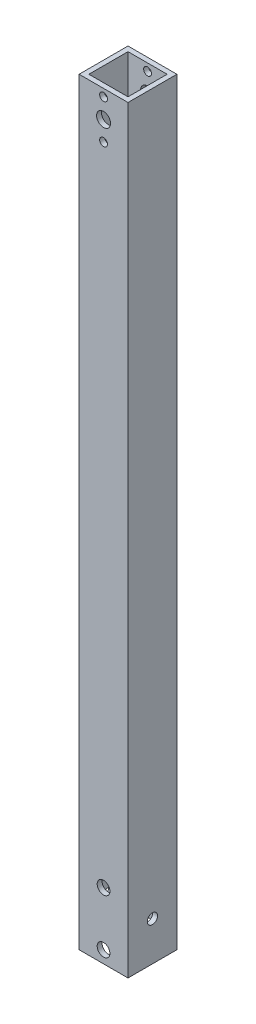
ISO-10303-21;
HEADER;
FILE_DESCRIPTION(('STEP AP214'),'2;1');
FILE_NAME('part.step','',(''),(''),'','','');
FILE_SCHEMA(('AUTOMOTIVE_DESIGN { 1 0 10303 214 1 1 1 1 }'));
ENDSEC;
DATA;
#1=APPLICATION_CONTEXT('core data for automotive mechanical design processes');
#2=APPLICATION_PROTOCOL_DEFINITION('international standard','automotive_design',2000,#1);
#3=PRODUCT_CONTEXT('',#1,'mechanical');
#4=PRODUCT('Part','Part','',(#3));
#5=PRODUCT_RELATED_PRODUCT_CATEGORY('part','',(#4));
#6=PRODUCT_DEFINITION_FORMATION('','',#4);
#7=PRODUCT_DEFINITION_CONTEXT('part definition',#1,'design');
#8=PRODUCT_DEFINITION('design','',#6,#7);
#9=PRODUCT_DEFINITION_SHAPE('','',#8);
#10=(LENGTH_UNIT() NAMED_UNIT(*) SI_UNIT(.MILLI.,.METRE.));
#11=(NAMED_UNIT(*) PLANE_ANGLE_UNIT() SI_UNIT($,.RADIAN.));
#12=(NAMED_UNIT(*) SI_UNIT($,.STERADIAN.) SOLID_ANGLE_UNIT());
#13=UNCERTAINTY_MEASURE_WITH_UNIT(LENGTH_MEASURE(1.E-05),#10,'distance_accuracy_value','');
#14=(GEOMETRIC_REPRESENTATION_CONTEXT(3) GLOBAL_UNCERTAINTY_ASSIGNED_CONTEXT((#13)) GLOBAL_UNIT_ASSIGNED_CONTEXT((#10,
#11,#12)) REPRESENTATION_CONTEXT('',''));
#15=CARTESIAN_POINT('',(0.,0.,0.));
#16=DIRECTION('',(0.,0.,1.));
#17=DIRECTION('',(1.,0.,0.));
#18=AXIS2_PLACEMENT_3D('',#15,#16,#17);
#19=CARTESIAN_POINT('',(0.,310.,0.));
#20=DIRECTION('',(0.,1.,0.));
#21=DIRECTION('',(0.,0.,1.));
#22=AXIS2_PLACEMENT_3D('',#19,#20,#21);
#23=PLANE('',#22);
#24=DIRECTION('',(0.,0.,1.));
#25=VECTOR('',#24,1.);
#26=CARTESIAN_POINT('',(0.,310.,0.));
#27=LINE('',#26,#25);
#28=CARTESIAN_POINT('',(0.,310.,-20.));
#29=VERTEX_POINT('',#28);
#30=CARTESIAN_POINT('',(0.,310.,0.));
#31=VERTEX_POINT('',#30);
#32=EDGE_CURVE('E166',#29,#31,#27,.T.);
#33=ORIENTED_EDGE('',*,*,#32,.T.);
#34=DIRECTION('',(1.,0.,0.));
#35=VECTOR('',#34,1.);
#36=CARTESIAN_POINT('',(0.,310.,0.));
#37=LINE('',#36,#35);
#38=CARTESIAN_POINT('',(20.,310.,0.));
#39=VERTEX_POINT('',#38);
#40=EDGE_CURVE('E169',#31,#39,#37,.T.);
#41=ORIENTED_EDGE('',*,*,#40,.T.);
#42=DIRECTION('',(0.,0.,-1.));
#43=VECTOR('',#42,1.);
#44=CARTESIAN_POINT('',(20.,310.,0.));
#45=LINE('',#44,#43);
#46=CARTESIAN_POINT('',(20.,310.,-20.));
#47=VERTEX_POINT('',#46);
#48=EDGE_CURVE('E172',#39,#47,#45,.T.);
#49=ORIENTED_EDGE('',*,*,#48,.T.);
#50=DIRECTION('',(-1.,0.,0.));
#51=VECTOR('',#50,1.);
#52=CARTESIAN_POINT('',(0.,310.,-20.));
#53=LINE('',#52,#51);
#54=EDGE_CURVE('E174',#47,#29,#53,.T.);
#55=ORIENTED_EDGE('',*,*,#54,.T.);
#56=EDGE_LOOP('',(#33,#41,#49,#55));
#57=FACE_BOUND('',#56,.T.);
#58=DIRECTION('',(1.,0.,0.));
#59=VECTOR('',#58,1.);
#60=CARTESIAN_POINT('',(0.,310.,-2.));
#61=LINE('',#60,#59);
#62=CARTESIAN_POINT('',(2.,310.,-2.));
#63=VERTEX_POINT('',#62);
#64=CARTESIAN_POINT('',(18.,310.,-2.));
#65=VERTEX_POINT('',#64);
#66=EDGE_CURVE('E136',#63,#65,#61,.T.);
#67=ORIENTED_EDGE('',*,*,#66,.F.);
#68=DIRECTION('',(0.,0.,1.));
#69=VECTOR('',#68,1.);
#70=CARTESIAN_POINT('',(2.,310.,0.));
#71=LINE('',#70,#69);
#72=CARTESIAN_POINT('',(2.,310.,-18.));
#73=VERTEX_POINT('',#72);
#74=EDGE_CURVE('E128',#73,#63,#71,.T.);
#75=ORIENTED_EDGE('',*,*,#74,.F.);
#76=DIRECTION('',(-1.,0.,0.));
#77=VECTOR('',#76,1.);
#78=CARTESIAN_POINT('',(0.,310.,-18.));
#79=LINE('',#78,#77);
#80=CARTESIAN_POINT('',(18.,310.,-18.));
#81=VERTEX_POINT('',#80);
#82=EDGE_CURVE('E150',#81,#73,#79,.T.);
#83=ORIENTED_EDGE('',*,*,#82,.F.);
#84=DIRECTION('',(0.,0.,-1.));
#85=VECTOR('',#84,1.);
#86=CARTESIAN_POINT('',(18.,310.,0.));
#87=LINE('',#86,#85);
#88=EDGE_CURVE('E148',#65,#81,#87,.T.);
#89=ORIENTED_EDGE('',*,*,#88,.F.);
#90=EDGE_LOOP('',(#67,#75,#83,#89));
#91=FACE_BOUND('',#90,.T.);
#92=ADVANCED_FACE('F61',(#57,#91),#23,.T.);
#93=CARTESIAN_POINT('',(0.,0.,0.));
#94=DIRECTION('',(0.,1.,0.));
#95=DIRECTION('',(0.,0.,1.));
#96=AXIS2_PLACEMENT_3D('',#93,#94,#95);
#97=PLANE('',#96);
#98=DIRECTION('',(0.,0.,1.));
#99=VECTOR('',#98,1.);
#100=CARTESIAN_POINT('',(0.,0.,0.));
#101=LINE('',#100,#99);
#102=CARTESIAN_POINT('',(0.,0.,-20.));
#103=VERTEX_POINT('',#102);
#104=CARTESIAN_POINT('',(0.,0.,0.));
#105=VERTEX_POINT('',#104);
#106=EDGE_CURVE('E144',#103,#105,#101,.T.);
#107=ORIENTED_EDGE('',*,*,#106,.F.);
#108=DIRECTION('',(-1.,0.,0.));
#109=VECTOR('',#108,1.);
#110=CARTESIAN_POINT('',(0.,0.,-20.));
#111=LINE('',#110,#109);
#112=CARTESIAN_POINT('',(20.,0.,-20.));
#113=VERTEX_POINT('',#112);
#114=EDGE_CURVE('E170',#113,#103,#111,.T.);
#115=ORIENTED_EDGE('',*,*,#114,.F.);
#116=DIRECTION('',(0.,0.,-1.));
#117=VECTOR('',#116,1.);
#118=CARTESIAN_POINT('',(20.,0.,0.));
#119=LINE('',#118,#117);
#120=CARTESIAN_POINT('',(20.,0.,0.));
#121=VERTEX_POINT('',#120);
#122=EDGE_CURVE('E181',#121,#113,#119,.T.);
#123=ORIENTED_EDGE('',*,*,#122,.F.);
#124=DIRECTION('',(1.,0.,0.));
#125=VECTOR('',#124,1.);
#126=CARTESIAN_POINT('',(0.,0.,0.));
#127=LINE('',#126,#125);
#128=EDGE_CURVE('E179',#105,#121,#127,.T.);
#129=ORIENTED_EDGE('',*,*,#128,.F.);
#130=EDGE_LOOP('',(#107,#115,#123,#129));
#131=FACE_BOUND('',#130,.T.);
#132=DIRECTION('',(0.,0.,1.));
#133=VECTOR('',#132,1.);
#134=CARTESIAN_POINT('',(2.,0.,0.));
#135=LINE('',#134,#133);
#136=CARTESIAN_POINT('',(2.,0.,-18.));
#137=VERTEX_POINT('',#136);
#138=CARTESIAN_POINT('',(2.,0.,-2.));
#139=VERTEX_POINT('',#138);
#140=EDGE_CURVE('E86',#137,#139,#135,.T.);
#141=ORIENTED_EDGE('',*,*,#140,.T.);
#142=DIRECTION('',(1.,0.,0.));
#143=VECTOR('',#142,1.);
#144=CARTESIAN_POINT('',(0.,0.,-2.));
#145=LINE('',#144,#143);
#146=CARTESIAN_POINT('',(18.,0.,-2.));
#147=VERTEX_POINT('',#146);
#148=EDGE_CURVE('E143',#139,#147,#145,.T.);
#149=ORIENTED_EDGE('',*,*,#148,.T.);
#150=DIRECTION('',(0.,0.,-1.));
#151=VECTOR('',#150,1.);
#152=CARTESIAN_POINT('',(18.,0.,0.));
#153=LINE('',#152,#151);
#154=CARTESIAN_POINT('',(18.,0.,-18.));
#155=VERTEX_POINT('',#154);
#156=EDGE_CURVE('E158',#147,#155,#153,.T.);
#157=ORIENTED_EDGE('',*,*,#156,.T.);
#158=DIRECTION('',(-1.,0.,0.));
#159=VECTOR('',#158,1.);
#160=CARTESIAN_POINT('',(0.,0.,-18.));
#161=LINE('',#160,#159);
#162=EDGE_CURVE('E137',#155,#137,#161,.T.);
#163=ORIENTED_EDGE('',*,*,#162,.T.);
#164=EDGE_LOOP('',(#141,#149,#157,#163));
#165=FACE_BOUND('',#164,.T.);
#166=ADVANCED_FACE('F280',(#131,#165),#97,.F.);
#167=CARTESIAN_POINT('',(0.,310.,0.));
#168=DIRECTION('',(1.,0.,0.));
#169=DIRECTION('',(0.,0.,-1.));
#170=AXIS2_PLACEMENT_3D('',#167,#168,#169);
#171=PLANE('',#170);
#172=CARTESIAN_POINT('',(0.,16.,-10.));
#173=DIRECTION('',(-1.,0.,0.));
#174=DIRECTION('',(0.,0.,1.));
#175=AXIS2_PLACEMENT_3D('',#172,#173,#174);
#176=CIRCLE('',#175,2.1);
#177=CARTESIAN_POINT('',(0.,16.,-7.9));
#178=VERTEX_POINT('',#177);
#179=EDGE_CURVE('E308',#178,#178,#176,.T.);
#180=ORIENTED_EDGE('',*,*,#179,.F.);
#181=EDGE_LOOP('',(#180));
#182=FACE_BOUND('',#181,.T.);
#183=ORIENTED_EDGE('',*,*,#106,.T.);
#184=DIRECTION('',(0.,-1.,0.));
#185=VECTOR('',#184,1.);
#186=CARTESIAN_POINT('',(0.,310.,0.));
#187=LINE('',#186,#185);
#188=EDGE_CURVE('E12',#31,#105,#187,.T.);
#189=ORIENTED_EDGE('',*,*,#188,.F.);
#190=ORIENTED_EDGE('',*,*,#32,.F.);
#191=DIRECTION('',(0.,-1.,0.));
#192=VECTOR('',#191,1.);
#193=CARTESIAN_POINT('',(0.,310.,-20.));
#194=LINE('',#193,#192);
#195=EDGE_CURVE('E176',#29,#103,#194,.T.);
#196=ORIENTED_EDGE('',*,*,#195,.T.);
#197=EDGE_LOOP('',(#183,#189,#190,#196));
#198=FACE_BOUND('',#197,.T.);
#199=ADVANCED_FACE('F63',(#182,#198),#171,.F.);
#200=CARTESIAN_POINT('',(0.,310.,0.));
#201=DIRECTION('',(0.,0.,-1.));
#202=DIRECTION('',(-1.,0.,0.));
#203=AXIS2_PLACEMENT_3D('',#200,#201,#202);
#204=PLANE('',#203);
#205=CARTESIAN_POINT('',(10.0000000000021,5.00000000000006,0.));
#206=DIRECTION('',(0.,0.,-1.));
#207=DIRECTION('',(-1.,0.,0.));
#208=AXIS2_PLACEMENT_3D('',#205,#206,#207);
#209=CIRCLE('',#208,2.6);
#210=CARTESIAN_POINT('',(7.40000000000211,5.00000000000006,0.));
#211=VERTEX_POINT('',#210);
#212=EDGE_CURVE('E206',#211,#211,#209,.T.);
#213=ORIENTED_EDGE('',*,*,#212,.T.);
#214=EDGE_LOOP('',(#213));
#215=FACE_BOUND('',#214,.T.);
#216=CARTESIAN_POINT('',(10.0000000000021,27.,0.));
#217=DIRECTION('',(0.,0.,-1.));
#218=DIRECTION('',(-1.,0.,0.));
#219=AXIS2_PLACEMENT_3D('',#216,#217,#218);
#220=CIRCLE('',#219,2.6);
#221=CARTESIAN_POINT('',(7.4000000000021,27.,0.));
#222=VERTEX_POINT('',#221);
#223=EDGE_CURVE('E321',#222,#222,#220,.T.);
#224=ORIENTED_EDGE('',*,*,#223,.T.);
#225=EDGE_LOOP('',(#224));
#226=FACE_BOUND('',#225,.T.);
#227=CARTESIAN_POINT('',(10.,307.,0.));
#228=DIRECTION('',(0.,0.,1.));
#229=DIRECTION('',(1.,0.,0.));
#230=AXIS2_PLACEMENT_3D('',#227,#228,#229);
#231=CIRCLE('',#230,1.59999999999999);
#232=CARTESIAN_POINT('',(11.6,307.,0.));
#233=VERTEX_POINT('',#232);
#234=EDGE_CURVE('E213',#233,#233,#231,.T.);
#235=ORIENTED_EDGE('',*,*,#234,.F.);
#236=EDGE_LOOP('',(#235));
#237=FACE_BOUND('',#236,.T.);
#238=CARTESIAN_POINT('',(10.,291.,0.));
#239=DIRECTION('',(0.,0.,1.));
#240=DIRECTION('',(1.,0.,0.));
#241=AXIS2_PLACEMENT_3D('',#238,#239,#240);
#242=CIRCLE('',#241,1.6);
#243=CARTESIAN_POINT('',(11.6,291.,0.));
#244=VERTEX_POINT('',#243);
#245=EDGE_CURVE('E227',#244,#244,#242,.T.);
#246=ORIENTED_EDGE('',*,*,#245,.F.);
#247=EDGE_LOOP('',(#246));
#248=FACE_BOUND('',#247,.T.);
#249=CARTESIAN_POINT('',(10.,299.,0.));
#250=DIRECTION('',(0.,0.,1.));
#251=DIRECTION('',(1.,0.,0.));
#252=AXIS2_PLACEMENT_3D('',#249,#250,#251);
#253=CIRCLE('',#252,2.84999999999999);
#254=CARTESIAN_POINT('',(12.85,299.,0.));
#255=VERTEX_POINT('',#254);
#256=EDGE_CURVE('E226',#255,#255,#253,.T.);
#257=ORIENTED_EDGE('',*,*,#256,.F.);
#258=EDGE_LOOP('',(#257));
#259=FACE_BOUND('',#258,.T.);
#260=ORIENTED_EDGE('',*,*,#128,.T.);
#261=DIRECTION('',(0.,-1.,0.));
#262=VECTOR('',#261,1.);
#263=CARTESIAN_POINT('',(20.,310.,0.));
#264=LINE('',#263,#262);
#265=EDGE_CURVE('E70',#39,#121,#264,.T.);
#266=ORIENTED_EDGE('',*,*,#265,.F.);
#267=ORIENTED_EDGE('',*,*,#40,.F.);
#268=ORIENTED_EDGE('',*,*,#188,.T.);
#269=EDGE_LOOP('',(#260,#266,#267,#268));
#270=FACE_BOUND('',#269,.T.);
#271=ADVANCED_FACE('F266',(#215,#226,#237,#248,#259,#270),#204,.F.);
#272=CARTESIAN_POINT('',(20.,310.,0.));
#273=DIRECTION('',(-1.,0.,0.));
#274=DIRECTION('',(0.,0.,1.));
#275=AXIS2_PLACEMENT_3D('',#272,#273,#274);
#276=PLANE('',#275);
#277=CARTESIAN_POINT('',(20.,16.,-10.));
#278=DIRECTION('',(-1.,0.,0.));
#279=DIRECTION('',(0.,0.,1.));
#280=AXIS2_PLACEMENT_3D('',#277,#278,#279);
#281=CIRCLE('',#280,2.1);
#282=CARTESIAN_POINT('',(20.,16.,-7.9));
#283=VERTEX_POINT('',#282);
#284=EDGE_CURVE('E306',#283,#283,#281,.T.);
#285=ORIENTED_EDGE('',*,*,#284,.T.);
#286=EDGE_LOOP('',(#285));
#287=FACE_BOUND('',#286,.T.);
#288=ORIENTED_EDGE('',*,*,#122,.T.);
#289=DIRECTION('',(0.,-1.,0.));
#290=VECTOR('',#289,1.);
#291=CARTESIAN_POINT('',(20.,310.,-20.));
#292=LINE('',#291,#290);
#293=EDGE_CURVE('E186',#47,#113,#292,.T.);
#294=ORIENTED_EDGE('',*,*,#293,.F.);
#295=ORIENTED_EDGE('',*,*,#48,.F.);
#296=ORIENTED_EDGE('',*,*,#265,.T.);
#297=EDGE_LOOP('',(#288,#294,#295,#296));
#298=FACE_BOUND('',#297,.T.);
#299=ADVANCED_FACE('F269',(#287,#298),#276,.F.);
#300=CARTESIAN_POINT('',(0.,310.,-20.));
#301=DIRECTION('',(0.,0.,1.));
#302=DIRECTION('',(1.,0.,0.));
#303=AXIS2_PLACEMENT_3D('',#300,#301,#302);
#304=PLANE('',#303);
#305=CARTESIAN_POINT('',(10.0000000000021,5.00000000000006,-20.));
#306=DIRECTION('',(0.,0.,-1.));
#307=DIRECTION('',(-1.,0.,0.));
#308=AXIS2_PLACEMENT_3D('',#305,#306,#307);
#309=CIRCLE('',#308,2.6);
#310=CARTESIAN_POINT('',(7.40000000000211,5.00000000000006,-20.));
#311=VERTEX_POINT('',#310);
#312=EDGE_CURVE('E319',#311,#311,#309,.T.);
#313=ORIENTED_EDGE('',*,*,#312,.F.);
#314=EDGE_LOOP('',(#313));
#315=FACE_BOUND('',#314,.T.);
#316=CARTESIAN_POINT('',(10.0000000000021,27.,-20.));
#317=DIRECTION('',(0.,0.,-1.));
#318=DIRECTION('',(-1.,0.,0.));
#319=AXIS2_PLACEMENT_3D('',#316,#317,#318);
#320=CIRCLE('',#319,2.6);
#321=CARTESIAN_POINT('',(7.4000000000021,27.,-20.));
#322=VERTEX_POINT('',#321);
#323=EDGE_CURVE('E220',#322,#322,#320,.T.);
#324=ORIENTED_EDGE('',*,*,#323,.F.);
#325=EDGE_LOOP('',(#324));
#326=FACE_BOUND('',#325,.T.);
#327=CARTESIAN_POINT('',(10.,307.,-20.));
#328=DIRECTION('',(0.,0.,1.));
#329=DIRECTION('',(1.,0.,0.));
#330=AXIS2_PLACEMENT_3D('',#327,#328,#329);
#331=CIRCLE('',#330,1.59999999999999);
#332=CARTESIAN_POINT('',(11.6,307.,-20.));
#333=VERTEX_POINT('',#332);
#334=EDGE_CURVE('E230',#333,#333,#331,.T.);
#335=ORIENTED_EDGE('',*,*,#334,.T.);
#336=EDGE_LOOP('',(#335));
#337=FACE_BOUND('',#336,.T.);
#338=CARTESIAN_POINT('',(10.,291.,-20.));
#339=DIRECTION('',(0.,0.,1.));
#340=DIRECTION('',(1.,0.,0.));
#341=AXIS2_PLACEMENT_3D('',#338,#339,#340);
#342=CIRCLE('',#341,1.6);
#343=CARTESIAN_POINT('',(11.6,291.,-20.));
#344=VERTEX_POINT('',#343);
#345=EDGE_CURVE('E223',#344,#344,#342,.T.);
#346=ORIENTED_EDGE('',*,*,#345,.T.);
#347=EDGE_LOOP('',(#346));
#348=FACE_BOUND('',#347,.T.);
#349=CARTESIAN_POINT('',(10.,299.,-20.));
#350=DIRECTION('',(0.,0.,1.));
#351=DIRECTION('',(1.,0.,0.));
#352=AXIS2_PLACEMENT_3D('',#349,#350,#351);
#353=CIRCLE('',#352,2.84999999999999);
#354=CARTESIAN_POINT('',(12.85,299.,-20.));
#355=VERTEX_POINT('',#354);
#356=EDGE_CURVE('E195',#355,#355,#353,.T.);
#357=ORIENTED_EDGE('',*,*,#356,.T.);
#358=EDGE_LOOP('',(#357));
#359=FACE_BOUND('',#358,.T.);
#360=ORIENTED_EDGE('',*,*,#114,.T.);
#361=ORIENTED_EDGE('',*,*,#195,.F.);
#362=ORIENTED_EDGE('',*,*,#54,.F.);
#363=ORIENTED_EDGE('',*,*,#293,.T.);
#364=EDGE_LOOP('',(#360,#361,#362,#363));
#365=FACE_BOUND('',#364,.T.);
#366=ADVANCED_FACE('F284',(#315,#326,#337,#348,#359,#365),#304,.F.);
#367=CARTESIAN_POINT('',(2.,310.,0.));
#368=DIRECTION('',(1.,0.,0.));
#369=DIRECTION('',(0.,0.,-1.));
#370=AXIS2_PLACEMENT_3D('',#367,#368,#369);
#371=PLANE('',#370);
#372=CARTESIAN_POINT('',(2.,16.,-10.));
#373=DIRECTION('',(1.,0.,0.));
#374=DIRECTION('',(0.,0.,-1.));
#375=AXIS2_PLACEMENT_3D('',#372,#373,#374);
#376=CIRCLE('',#375,2.1);
#377=CARTESIAN_POINT('',(2.,16.,-12.1));
#378=VERTEX_POINT('',#377);
#379=EDGE_CURVE('E311',#378,#378,#376,.T.);
#380=ORIENTED_EDGE('',*,*,#379,.F.);
#381=EDGE_LOOP('',(#380));
#382=FACE_BOUND('',#381,.T.);
#383=ORIENTED_EDGE('',*,*,#140,.F.);
#384=DIRECTION('',(0.,-1.,0.));
#385=VECTOR('',#384,1.);
#386=CARTESIAN_POINT('',(2.,310.,-18.));
#387=LINE('',#386,#385);
#388=EDGE_CURVE('E132',#73,#137,#387,.T.);
#389=ORIENTED_EDGE('',*,*,#388,.F.);
#390=ORIENTED_EDGE('',*,*,#74,.T.);
#391=DIRECTION('',(0.,-1.,0.));
#392=VECTOR('',#391,1.);
#393=CARTESIAN_POINT('',(2.,310.,-2.));
#394=LINE('',#393,#392);
#395=EDGE_CURVE('E131',#63,#139,#394,.T.);
#396=ORIENTED_EDGE('',*,*,#395,.T.);
#397=EDGE_LOOP('',(#383,#389,#390,#396));
#398=FACE_BOUND('',#397,.T.);
#399=ADVANCED_FACE('F130',(#382,#398),#371,.T.);
#400=CARTESIAN_POINT('',(0.,310.,-2.));
#401=DIRECTION('',(0.,0.,-1.));
#402=DIRECTION('',(-1.,0.,0.));
#403=AXIS2_PLACEMENT_3D('',#400,#401,#402);
#404=PLANE('',#403);
#405=CARTESIAN_POINT('',(10.0000000000021,5.00000000000006,-2.));
#406=DIRECTION('',(0.,0.,-1.));
#407=DIRECTION('',(-1.,0.,0.));
#408=AXIS2_PLACEMENT_3D('',#405,#406,#407);
#409=CIRCLE('',#408,2.6);
#410=CARTESIAN_POINT('',(7.40000000000211,5.00000000000006,-2.));
#411=VERTEX_POINT('',#410);
#412=EDGE_CURVE('E209',#411,#411,#409,.T.);
#413=ORIENTED_EDGE('',*,*,#412,.F.);
#414=EDGE_LOOP('',(#413));
#415=FACE_BOUND('',#414,.T.);
#416=CARTESIAN_POINT('',(10.0000000000021,27.,-2.));
#417=DIRECTION('',(0.,0.,-1.));
#418=DIRECTION('',(-1.,0.,0.));
#419=AXIS2_PLACEMENT_3D('',#416,#417,#418);
#420=CIRCLE('',#419,2.6);
#421=CARTESIAN_POINT('',(7.4000000000021,27.,-2.));
#422=VERTEX_POINT('',#421);
#423=EDGE_CURVE('E205',#422,#422,#420,.T.);
#424=ORIENTED_EDGE('',*,*,#423,.F.);
#425=EDGE_LOOP('',(#424));
#426=FACE_BOUND('',#425,.T.);
#427=CARTESIAN_POINT('',(10.,307.,-2.));
#428=DIRECTION('',(0.,0.,-1.));
#429=DIRECTION('',(-1.,0.,0.));
#430=AXIS2_PLACEMENT_3D('',#427,#428,#429);
#431=CIRCLE('',#430,1.59999999999999);
#432=CARTESIAN_POINT('',(8.40000000000001,307.,-2.));
#433=VERTEX_POINT('',#432);
#434=EDGE_CURVE('E156',#433,#433,#431,.T.);
#435=ORIENTED_EDGE('',*,*,#434,.F.);
#436=EDGE_LOOP('',(#435));
#437=FACE_BOUND('',#436,.T.);
#438=CARTESIAN_POINT('',(10.,291.,-2.));
#439=DIRECTION('',(0.,0.,-1.));
#440=DIRECTION('',(-1.,0.,0.));
#441=AXIS2_PLACEMENT_3D('',#438,#439,#440);
#442=CIRCLE('',#441,1.6);
#443=CARTESIAN_POINT('',(8.40000000000001,291.,-2.));
#444=VERTEX_POINT('',#443);
#445=EDGE_CURVE('E199',#444,#444,#442,.T.);
#446=ORIENTED_EDGE('',*,*,#445,.F.);
#447=EDGE_LOOP('',(#446));
#448=FACE_BOUND('',#447,.T.);
#449=CARTESIAN_POINT('',(10.,299.,-2.));
#450=DIRECTION('',(0.,0.,-1.));
#451=DIRECTION('',(-1.,0.,0.));
#452=AXIS2_PLACEMENT_3D('',#449,#450,#451);
#453=CIRCLE('',#452,2.84999999999999);
#454=CARTESIAN_POINT('',(7.15000000000001,299.,-2.));
#455=VERTEX_POINT('',#454);
#456=EDGE_CURVE('E194',#455,#455,#453,.T.);
#457=ORIENTED_EDGE('',*,*,#456,.F.);
#458=EDGE_LOOP('',(#457));
#459=FACE_BOUND('',#458,.T.);
#460=ORIENTED_EDGE('',*,*,#148,.F.);
#461=ORIENTED_EDGE('',*,*,#395,.F.);
#462=ORIENTED_EDGE('',*,*,#66,.T.);
#463=DIRECTION('',(0.,-1.,0.));
#464=VECTOR('',#463,1.);
#465=CARTESIAN_POINT('',(18.,310.,-2.));
#466=LINE('',#465,#464);
#467=EDGE_CURVE('E145',#65,#147,#466,.T.);
#468=ORIENTED_EDGE('',*,*,#467,.T.);
#469=EDGE_LOOP('',(#460,#461,#462,#468));
#470=FACE_BOUND('',#469,.T.);
#471=ADVANCED_FACE('F140',(#415,#426,#437,#448,#459,#470),#404,.T.);
#472=CARTESIAN_POINT('',(18.,310.,0.));
#473=DIRECTION('',(-1.,0.,0.));
#474=DIRECTION('',(0.,0.,1.));
#475=AXIS2_PLACEMENT_3D('',#472,#473,#474);
#476=PLANE('',#475);
#477=CARTESIAN_POINT('',(18.,16.,-10.));
#478=DIRECTION('',(-1.,0.,0.));
#479=DIRECTION('',(0.,0.,1.));
#480=AXIS2_PLACEMENT_3D('',#477,#478,#479);
#481=CIRCLE('',#480,2.1);
#482=CARTESIAN_POINT('',(18.,16.,-7.9));
#483=VERTEX_POINT('',#482);
#484=EDGE_CURVE('E65',#483,#483,#481,.T.);
#485=ORIENTED_EDGE('',*,*,#484,.F.);
#486=EDGE_LOOP('',(#485));
#487=FACE_BOUND('',#486,.T.);
#488=ORIENTED_EDGE('',*,*,#156,.F.);
#489=ORIENTED_EDGE('',*,*,#467,.F.);
#490=ORIENTED_EDGE('',*,*,#88,.T.);
#491=DIRECTION('',(0.,-1.,0.));
#492=VECTOR('',#491,1.);
#493=CARTESIAN_POINT('',(18.,310.,-18.));
#494=LINE('',#493,#492);
#495=EDGE_CURVE('E78',#81,#155,#494,.T.);
#496=ORIENTED_EDGE('',*,*,#495,.T.);
#497=EDGE_LOOP('',(#488,#489,#490,#496));
#498=FACE_BOUND('',#497,.T.);
#499=ADVANCED_FACE('F250',(#487,#498),#476,.T.);
#500=CARTESIAN_POINT('',(0.,310.,-18.));
#501=DIRECTION('',(0.,0.,1.));
#502=DIRECTION('',(1.,0.,0.));
#503=AXIS2_PLACEMENT_3D('',#500,#501,#502);
#504=PLANE('',#503);
#505=CARTESIAN_POINT('',(10.0000000000021,5.00000000000006,-18.));
#506=DIRECTION('',(0.,0.,1.));
#507=DIRECTION('',(1.,0.,0.));
#508=AXIS2_PLACEMENT_3D('',#505,#506,#507);
#509=CIRCLE('',#508,2.6);
#510=CARTESIAN_POINT('',(12.6000000000021,5.00000000000006,-18.));
#511=VERTEX_POINT('',#510);
#512=EDGE_CURVE('E207',#511,#511,#509,.T.);
#513=ORIENTED_EDGE('',*,*,#512,.F.);
#514=EDGE_LOOP('',(#513));
#515=FACE_BOUND('',#514,.T.);
#516=CARTESIAN_POINT('',(10.0000000000021,27.,-18.));
#517=DIRECTION('',(0.,0.,1.));
#518=DIRECTION('',(1.,0.,0.));
#519=AXIS2_PLACEMENT_3D('',#516,#517,#518);
#520=CIRCLE('',#519,2.6);
#521=CARTESIAN_POINT('',(12.6000000000021,27.,-18.));
#522=VERTEX_POINT('',#521);
#523=EDGE_CURVE('E203',#522,#522,#520,.T.);
#524=ORIENTED_EDGE('',*,*,#523,.F.);
#525=EDGE_LOOP('',(#524));
#526=FACE_BOUND('',#525,.T.);
#527=CARTESIAN_POINT('',(10.,307.,-18.));
#528=DIRECTION('',(0.,0.,1.));
#529=DIRECTION('',(1.,0.,0.));
#530=AXIS2_PLACEMENT_3D('',#527,#528,#529);
#531=CIRCLE('',#530,1.59999999999999);
#532=CARTESIAN_POINT('',(11.6,307.,-18.));
#533=VERTEX_POINT('',#532);
#534=EDGE_CURVE('E200',#533,#533,#531,.T.);
#535=ORIENTED_EDGE('',*,*,#534,.F.);
#536=EDGE_LOOP('',(#535));
#537=FACE_BOUND('',#536,.T.);
#538=CARTESIAN_POINT('',(10.,291.,-18.));
#539=DIRECTION('',(0.,0.,1.));
#540=DIRECTION('',(1.,0.,0.));
#541=AXIS2_PLACEMENT_3D('',#538,#539,#540);
#542=CIRCLE('',#541,1.6);
#543=CARTESIAN_POINT('',(11.6,291.,-18.));
#544=VERTEX_POINT('',#543);
#545=EDGE_CURVE('E196',#544,#544,#542,.T.);
#546=ORIENTED_EDGE('',*,*,#545,.F.);
#547=EDGE_LOOP('',(#546));
#548=FACE_BOUND('',#547,.T.);
#549=CARTESIAN_POINT('',(10.,299.,-18.));
#550=DIRECTION('',(0.,0.,1.));
#551=DIRECTION('',(1.,0.,0.));
#552=AXIS2_PLACEMENT_3D('',#549,#550,#551);
#553=CIRCLE('',#552,2.84999999999999);
#554=CARTESIAN_POINT('',(12.85,299.,-18.));
#555=VERTEX_POINT('',#554);
#556=EDGE_CURVE('E191',#555,#555,#553,.T.);
#557=ORIENTED_EDGE('',*,*,#556,.F.);
#558=EDGE_LOOP('',(#557));
#559=FACE_BOUND('',#558,.T.);
#560=ORIENTED_EDGE('',*,*,#162,.F.);
#561=ORIENTED_EDGE('',*,*,#495,.F.);
#562=ORIENTED_EDGE('',*,*,#82,.T.);
#563=ORIENTED_EDGE('',*,*,#388,.T.);
#564=EDGE_LOOP('',(#560,#561,#562,#563));
#565=FACE_BOUND('',#564,.T.);
#566=ADVANCED_FACE('F339',(#515,#526,#537,#548,#559,#565),#504,.T.);
#567=CARTESIAN_POINT('',(10.,299.,-20.));
#568=DIRECTION('',(0.,0.,1.));
#569=DIRECTION('',(1.,0.,0.));
#570=AXIS2_PLACEMENT_3D('',#567,#568,#569);
#571=CYLINDRICAL_SURFACE('',#570,2.84999999999999);
#572=ORIENTED_EDGE('',*,*,#556,.T.);
#573=EDGE_LOOP('',(#572));
#574=FACE_BOUND('',#573,.T.);
#575=ORIENTED_EDGE('',*,*,#356,.F.);
#576=EDGE_LOOP('',(#575));
#577=FACE_BOUND('',#576,.T.);
#578=ADVANCED_FACE('F263',(#574,#577),#571,.F.);
#579=CARTESIAN_POINT('',(10.,291.,-20.));
#580=DIRECTION('',(0.,0.,1.));
#581=DIRECTION('',(1.,0.,0.));
#582=AXIS2_PLACEMENT_3D('',#579,#580,#581);
#583=CYLINDRICAL_SURFACE('',#582,1.6);
#584=ORIENTED_EDGE('',*,*,#545,.T.);
#585=EDGE_LOOP('',(#584));
#586=FACE_BOUND('',#585,.T.);
#587=ORIENTED_EDGE('',*,*,#345,.F.);
#588=EDGE_LOOP('',(#587));
#589=FACE_BOUND('',#588,.T.);
#590=ADVANCED_FACE('F338',(#586,#589),#583,.F.);
#591=CARTESIAN_POINT('',(10.,307.,-20.));
#592=DIRECTION('',(0.,0.,1.));
#593=DIRECTION('',(1.,0.,0.));
#594=AXIS2_PLACEMENT_3D('',#591,#592,#593);
#595=CYLINDRICAL_SURFACE('',#594,1.59999999999999);
#596=ORIENTED_EDGE('',*,*,#534,.T.);
#597=EDGE_LOOP('',(#596));
#598=FACE_BOUND('',#597,.T.);
#599=ORIENTED_EDGE('',*,*,#334,.F.);
#600=EDGE_LOOP('',(#599));
#601=FACE_BOUND('',#600,.T.);
#602=ADVANCED_FACE('F261',(#598,#601),#595,.F.);
#603=ORIENTED_EDGE('',*,*,#456,.T.);
#604=EDGE_LOOP('',(#603));
#605=FACE_BOUND('',#604,.T.);
#606=ORIENTED_EDGE('',*,*,#256,.T.);
#607=EDGE_LOOP('',(#606));
#608=FACE_BOUND('',#607,.T.);
#609=ADVANCED_FACE('F257',(#605,#608),#571,.F.);
#610=ORIENTED_EDGE('',*,*,#445,.T.);
#611=EDGE_LOOP('',(#610));
#612=FACE_BOUND('',#611,.T.);
#613=ORIENTED_EDGE('',*,*,#245,.T.);
#614=EDGE_LOOP('',(#613));
#615=FACE_BOUND('',#614,.T.);
#616=ADVANCED_FACE('F260',(#612,#615),#583,.F.);
#617=ORIENTED_EDGE('',*,*,#434,.T.);
#618=EDGE_LOOP('',(#617));
#619=FACE_BOUND('',#618,.T.);
#620=ORIENTED_EDGE('',*,*,#234,.T.);
#621=EDGE_LOOP('',(#620));
#622=FACE_BOUND('',#621,.T.);
#623=ADVANCED_FACE('F245',(#619,#622),#595,.F.);
#624=CARTESIAN_POINT('',(10.0000000000021,27.,0.));
#625=DIRECTION('',(0.,0.,-1.));
#626=DIRECTION('',(-1.,0.,0.));
#627=AXIS2_PLACEMENT_3D('',#624,#625,#626);
#628=CYLINDRICAL_SURFACE('',#627,2.6);
#629=ORIENTED_EDGE('',*,*,#523,.T.);
#630=EDGE_LOOP('',(#629));
#631=FACE_BOUND('',#630,.T.);
#632=ORIENTED_EDGE('',*,*,#323,.T.);
#633=EDGE_LOOP('',(#632));
#634=FACE_BOUND('',#633,.T.);
#635=ADVANCED_FACE('F328',(#631,#634),#628,.F.);
#636=CARTESIAN_POINT('',(10.0000000000021,5.00000000000006,0.));
#637=DIRECTION('',(0.,0.,-1.));
#638=DIRECTION('',(-1.,0.,0.));
#639=AXIS2_PLACEMENT_3D('',#636,#637,#638);
#640=CYLINDRICAL_SURFACE('',#639,2.6);
#641=ORIENTED_EDGE('',*,*,#512,.T.);
#642=EDGE_LOOP('',(#641));
#643=FACE_BOUND('',#642,.T.);
#644=ORIENTED_EDGE('',*,*,#312,.T.);
#645=EDGE_LOOP('',(#644));
#646=FACE_BOUND('',#645,.T.);
#647=ADVANCED_FACE('F372',(#643,#646),#640,.F.);
#648=ORIENTED_EDGE('',*,*,#423,.T.);
#649=EDGE_LOOP('',(#648));
#650=FACE_BOUND('',#649,.T.);
#651=ORIENTED_EDGE('',*,*,#223,.F.);
#652=EDGE_LOOP('',(#651));
#653=FACE_BOUND('',#652,.T.);
#654=ADVANCED_FACE('F369',(#650,#653),#628,.F.);
#655=ORIENTED_EDGE('',*,*,#412,.T.);
#656=EDGE_LOOP('',(#655));
#657=FACE_BOUND('',#656,.T.);
#658=ORIENTED_EDGE('',*,*,#212,.F.);
#659=EDGE_LOOP('',(#658));
#660=FACE_BOUND('',#659,.T.);
#661=ADVANCED_FACE('F362',(#657,#660),#640,.F.);
#662=CARTESIAN_POINT('',(20.,16.,-10.));
#663=DIRECTION('',(-1.,0.,0.));
#664=DIRECTION('',(0.,0.,1.));
#665=AXIS2_PLACEMENT_3D('',#662,#663,#664);
#666=CYLINDRICAL_SURFACE('',#665,2.1);
#667=ORIENTED_EDGE('',*,*,#484,.T.);
#668=EDGE_LOOP('',(#667));
#669=FACE_BOUND('',#668,.T.);
#670=ORIENTED_EDGE('',*,*,#284,.F.);
#671=EDGE_LOOP('',(#670));
#672=FACE_BOUND('',#671,.T.);
#673=ADVANCED_FACE('F359',(#669,#672),#666,.F.);
#674=ORIENTED_EDGE('',*,*,#379,.T.);
#675=EDGE_LOOP('',(#674));
#676=FACE_BOUND('',#675,.T.);
#677=ORIENTED_EDGE('',*,*,#179,.T.);
#678=EDGE_LOOP('',(#677));
#679=FACE_BOUND('',#678,.T.);
#680=ADVANCED_FACE('F361',(#676,#679),#666,.F.);
#681=CLOSED_SHELL('',(#92,#166,#199,#271,#299,#366,#399,#471,#499,#566,#578,#590,#602,#609,#616,
#623,#635,#647,#654,#661,#673,#680));
#682=MANIFOLD_SOLID_BREP('B2',#681);
#683=ADVANCED_BREP_SHAPE_REPRESENTATION('',(#18,#682),#14);
#684=SHAPE_DEFINITION_REPRESENTATION(#9,#683);
ENDSEC;
END-ISO-10303-21;
